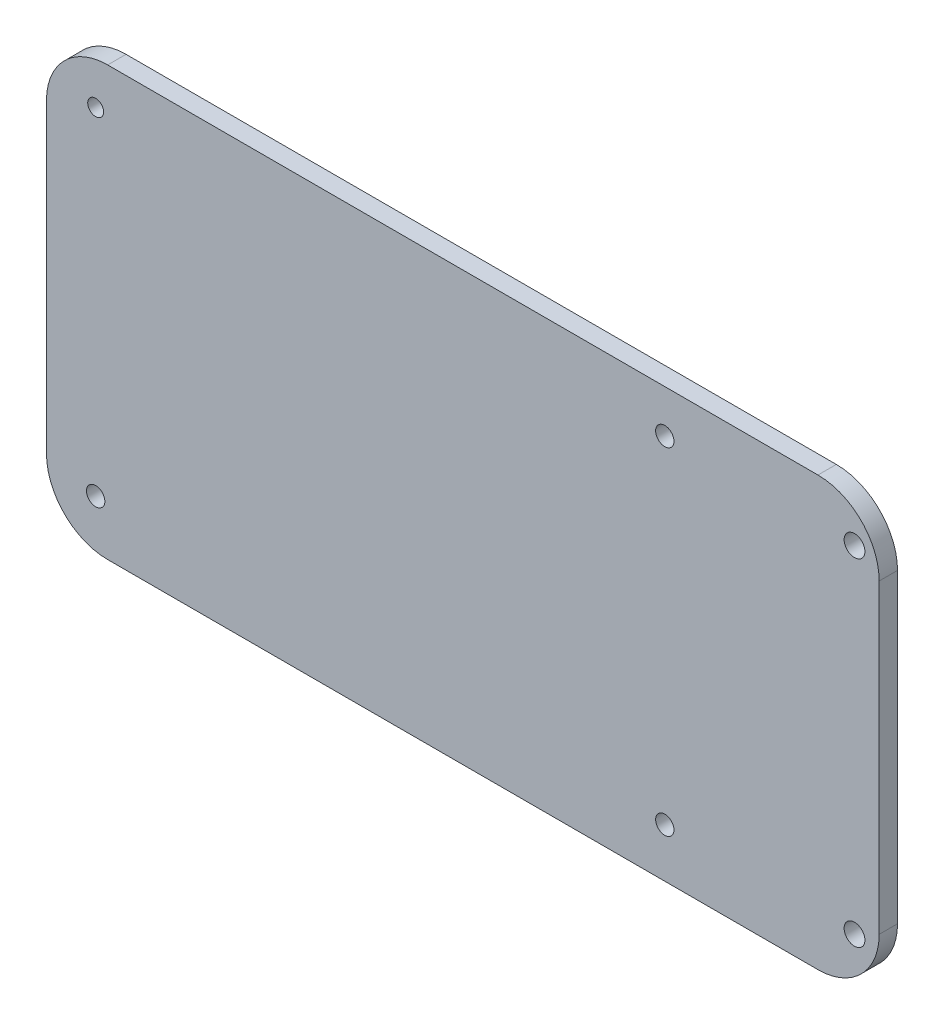
ISO-10303-21;
HEADER;
FILE_DESCRIPTION(('STEP AP214'),'2;1');
FILE_NAME('part.step','',(''),(''),'','','');
FILE_SCHEMA(('AUTOMOTIVE_DESIGN { 1 0 10303 214 1 1 1 1 }'));
ENDSEC;
DATA;
#1=APPLICATION_CONTEXT('core data for automotive mechanical design processes');
#2=APPLICATION_PROTOCOL_DEFINITION('international standard','automotive_design',2000,#1);
#3=PRODUCT_CONTEXT('',#1,'mechanical');
#4=PRODUCT('Part','Part','',(#3));
#5=PRODUCT_RELATED_PRODUCT_CATEGORY('part','',(#4));
#6=PRODUCT_DEFINITION_FORMATION('','',#4);
#7=PRODUCT_DEFINITION_CONTEXT('part definition',#1,'design');
#8=PRODUCT_DEFINITION('design','',#6,#7);
#9=PRODUCT_DEFINITION_SHAPE('','',#8);
#10=(LENGTH_UNIT() NAMED_UNIT(*) SI_UNIT(.MILLI.,.METRE.));
#11=(NAMED_UNIT(*) PLANE_ANGLE_UNIT() SI_UNIT($,.RADIAN.));
#12=(NAMED_UNIT(*) SI_UNIT($,.STERADIAN.) SOLID_ANGLE_UNIT());
#13=UNCERTAINTY_MEASURE_WITH_UNIT(LENGTH_MEASURE(1.E-05),#10,'distance_accuracy_value','');
#14=(GEOMETRIC_REPRESENTATION_CONTEXT(3) GLOBAL_UNCERTAINTY_ASSIGNED_CONTEXT((#13)) GLOBAL_UNIT_ASSIGNED_CONTEXT((#10,
#11,#12)) REPRESENTATION_CONTEXT('',''));
#15=CARTESIAN_POINT('',(0.,0.,0.));
#16=DIRECTION('',(0.,0.,1.));
#17=DIRECTION('',(1.,0.,0.));
#18=AXIS2_PLACEMENT_3D('',#15,#16,#17);
#19=CARTESIAN_POINT('',(59.0949387205515,11.9789527620131,3.));
#20=DIRECTION('',(0.,0.,1.));
#21=DIRECTION('',(1.,0.,0.));
#22=AXIS2_PLACEMENT_3D('',#19,#20,#21);
#23=PLANE('',#22);
#24=CARTESIAN_POINT('',(65.0658166856361,-40.0210472379869,3.));
#25=DIRECTION('',(0.,0.,-1.));
#26=DIRECTION('',(-1.,0.,0.));
#27=AXIS2_PLACEMENT_3D('',#24,#25,#26);
#28=CIRCLE('',#27,1.69999999999999);
#29=CARTESIAN_POINT('',(63.3658166856361,-40.0210472379869,3.));
#30=VERTEX_POINT('',#29);
#31=EDGE_CURVE('E207',#30,#30,#28,.T.);
#32=ORIENTED_EDGE('',*,*,#31,.T.);
#33=EDGE_LOOP('',(#32));
#34=FACE_BOUND('',#33,.T.);
#35=CARTESIAN_POINT('',(65.0658166856361,14.9789527620131,3.));
#36=DIRECTION('',(0.,0.,-1.));
#37=DIRECTION('',(-1.,0.,0.));
#38=AXIS2_PLACEMENT_3D('',#35,#36,#37);
#39=CIRCLE('',#38,1.69999999999999);
#40=CARTESIAN_POINT('',(63.3658166856361,14.9789527620131,3.));
#41=VERTEX_POINT('',#40);
#42=EDGE_CURVE('E199',#41,#41,#39,.T.);
#43=ORIENTED_EDGE('',*,*,#42,.T.);
#44=EDGE_LOOP('',(#43));
#45=FACE_BOUND('',#44,.T.);
#46=CARTESIAN_POINT('',(34.0682801600807,-40.0210472379869,3.));
#47=DIRECTION('',(0.,0.,1.));
#48=DIRECTION('',(1.,0.,0.));
#49=AXIS2_PLACEMENT_3D('',#46,#47,#48);
#50=CIRCLE('',#49,1.5);
#51=CARTESIAN_POINT('',(35.5682801600807,-40.0210472379869,3.));
#52=VERTEX_POINT('',#51);
#53=EDGE_CURVE('E187',#52,#52,#50,.T.);
#54=ORIENTED_EDGE('',*,*,#53,.F.);
#55=EDGE_LOOP('',(#54));
#56=FACE_BOUND('',#55,.T.);
#57=CARTESIAN_POINT('',(-58.9317198399192,14.9789527620131,3.));
#58=DIRECTION('',(0.,0.,1.));
#59=DIRECTION('',(1.,0.,0.));
#60=AXIS2_PLACEMENT_3D('',#57,#58,#59);
#61=CIRCLE('',#60,1.29999999999999);
#62=CARTESIAN_POINT('',(-57.6317198399192,14.9789527620131,3.));
#63=VERTEX_POINT('',#62);
#64=EDGE_CURVE('E133',#63,#63,#61,.T.);
#65=ORIENTED_EDGE('',*,*,#64,.F.);
#66=EDGE_LOOP('',(#65));
#67=FACE_BOUND('',#66,.T.);
#68=CARTESIAN_POINT('',(59.0949387205515,11.9789527620131,3.));
#69=DIRECTION('',(0.,0.,1.));
#70=DIRECTION('',(1.,0.,0.));
#71=AXIS2_PLACEMENT_3D('',#68,#69,#70);
#72=CIRCLE('',#71,10.);
#73=CARTESIAN_POINT('',(69.0949387205515,11.9789527620131,3.));
#74=VERTEX_POINT('',#73);
#75=CARTESIAN_POINT('',(59.0949387205515,21.9789527620131,3.));
#76=VERTEX_POINT('',#75);
#77=EDGE_CURVE('E144',#74,#76,#72,.T.);
#78=ORIENTED_EDGE('',*,*,#77,.T.);
#79=DIRECTION('',(-1.,0.,0.));
#80=VECTOR('',#79,1.);
#81=CARTESIAN_POINT('',(59.0949387205515,21.9789527620131,3.));
#82=LINE('',#81,#80);
#83=CARTESIAN_POINT('',(-56.9683201276188,21.9789527620131,3.));
#84=VERTEX_POINT('',#83);
#85=EDGE_CURVE('E92',#76,#84,#82,.T.);
#86=ORIENTED_EDGE('',*,*,#85,.T.);
#87=CARTESIAN_POINT('',(-56.9683201276189,11.9789527620131,3.));
#88=DIRECTION('',(0.,0.,1.));
#89=DIRECTION('',(-1.,0.,0.));
#90=AXIS2_PLACEMENT_3D('',#87,#88,#89);
#91=CIRCLE('',#90,10.);
#92=CARTESIAN_POINT('',(-66.9683201276189,11.978952762013,3.));
#93=VERTEX_POINT('',#92);
#94=EDGE_CURVE('E159',#84,#93,#91,.T.);
#95=ORIENTED_EDGE('',*,*,#94,.T.);
#96=DIRECTION('',(0.,-1.,0.));
#97=VECTOR('',#96,1.);
#98=CARTESIAN_POINT('',(-66.9683201276189,11.978952762013,3.));
#99=LINE('',#98,#97);
#100=CARTESIAN_POINT('',(-66.9683201276189,-38.0210472379869,3.));
#101=VERTEX_POINT('',#100);
#102=EDGE_CURVE('E172',#93,#101,#99,.T.);
#103=ORIENTED_EDGE('',*,*,#102,.T.);
#104=CARTESIAN_POINT('',(-56.9683201276189,-38.0210472379869,3.));
#105=DIRECTION('',(0.,0.,1.));
#106=DIRECTION('',(1.,0.,0.));
#107=AXIS2_PLACEMENT_3D('',#104,#105,#106);
#108=CIRCLE('',#107,9.99999999999999);
#109=CARTESIAN_POINT('',(-56.9683201276188,-48.0210472379869,3.));
#110=VERTEX_POINT('',#109);
#111=EDGE_CURVE('E111',#101,#110,#108,.T.);
#112=ORIENTED_EDGE('',*,*,#111,.T.);
#113=DIRECTION('',(1.,0.,0.));
#114=VECTOR('',#113,1.);
#115=CARTESIAN_POINT('',(-56.9683201276188,-48.0210472379869,3.));
#116=LINE('',#115,#114);
#117=CARTESIAN_POINT('',(59.0949387205516,-48.0210472379869,3.));
#118=VERTEX_POINT('',#117);
#119=EDGE_CURVE('E105',#110,#118,#116,.T.);
#120=ORIENTED_EDGE('',*,*,#119,.T.);
#121=CARTESIAN_POINT('',(59.0949387205515,-38.0210472379869,3.));
#122=DIRECTION('',(0.,0.,1.));
#123=DIRECTION('',(1.,0.,0.));
#124=AXIS2_PLACEMENT_3D('',#121,#122,#123);
#125=CIRCLE('',#124,10.);
#126=CARTESIAN_POINT('',(69.0949387205515,-38.0210472379869,3.));
#127=VERTEX_POINT('',#126);
#128=EDGE_CURVE('E109',#118,#127,#125,.T.);
#129=ORIENTED_EDGE('',*,*,#128,.T.);
#130=DIRECTION('',(0.,1.,0.));
#131=VECTOR('',#130,1.);
#132=CARTESIAN_POINT('',(69.0949387205515,11.9789527620131,3.));
#133=LINE('',#132,#131);
#134=EDGE_CURVE('E49',#127,#74,#133,.T.);
#135=ORIENTED_EDGE('',*,*,#134,.T.);
#136=EDGE_LOOP('',(#78,#86,#95,#103,#112,#120,#129,#135));
#137=FACE_BOUND('',#136,.T.);
#138=CARTESIAN_POINT('',(34.0682801600808,14.9789527620131,3.));
#139=DIRECTION('',(0.,0.,1.));
#140=DIRECTION('',(1.,0.,0.));
#141=AXIS2_PLACEMENT_3D('',#138,#139,#140);
#142=CIRCLE('',#141,1.5);
#143=CARTESIAN_POINT('',(35.5682801600807,14.9789527620131,3.));
#144=VERTEX_POINT('',#143);
#145=EDGE_CURVE('E181',#144,#144,#142,.T.);
#146=ORIENTED_EDGE('',*,*,#145,.F.);
#147=EDGE_LOOP('',(#146));
#148=FACE_BOUND('',#147,.T.);
#149=CARTESIAN_POINT('',(-58.9317198399193,-40.0210472379869,3.));
#150=DIRECTION('',(0.,0.,1.));
#151=DIRECTION('',(1.,0.,0.));
#152=AXIS2_PLACEMENT_3D('',#149,#150,#151);
#153=CIRCLE('',#152,1.5);
#154=CARTESIAN_POINT('',(-57.4317198399193,-40.0210472379869,3.));
#155=VERTEX_POINT('',#154);
#156=EDGE_CURVE('E193',#155,#155,#153,.T.);
#157=ORIENTED_EDGE('',*,*,#156,.F.);
#158=EDGE_LOOP('',(#157));
#159=FACE_BOUND('',#158,.T.);
#160=ADVANCED_FACE('F32',(#34,#45,#56,#67,#137,#148,#159),#23,.T.);
#161=CARTESIAN_POINT('',(59.0949387205515,11.9789527620131,0.));
#162=DIRECTION('',(0.,0.,1.));
#163=DIRECTION('',(1.,0.,0.));
#164=AXIS2_PLACEMENT_3D('',#161,#162,#163);
#165=PLANE('',#164);
#166=CARTESIAN_POINT('',(65.0658166856361,-40.0210472379869,0.));
#167=DIRECTION('',(0.,0.,-1.));
#168=DIRECTION('',(-1.,0.,0.));
#169=AXIS2_PLACEMENT_3D('',#166,#167,#168);
#170=CIRCLE('',#169,1.69999999999999);
#171=CARTESIAN_POINT('',(63.3658166856361,-40.0210472379869,0.));
#172=VERTEX_POINT('',#171);
#173=EDGE_CURVE('E210',#172,#172,#170,.T.);
#174=ORIENTED_EDGE('',*,*,#173,.F.);
#175=EDGE_LOOP('',(#174));
#176=FACE_BOUND('',#175,.T.);
#177=CARTESIAN_POINT('',(65.0658166856361,14.9789527620131,0.));
#178=DIRECTION('',(0.,0.,-1.));
#179=DIRECTION('',(-1.,0.,0.));
#180=AXIS2_PLACEMENT_3D('',#177,#178,#179);
#181=CIRCLE('',#180,1.69999999999999);
#182=CARTESIAN_POINT('',(63.3658166856361,14.9789527620131,0.));
#183=VERTEX_POINT('',#182);
#184=EDGE_CURVE('E204',#183,#183,#181,.T.);
#185=ORIENTED_EDGE('',*,*,#184,.F.);
#186=EDGE_LOOP('',(#185));
#187=FACE_BOUND('',#186,.T.);
#188=CARTESIAN_POINT('',(34.0682801600807,-40.0210472379869,0.));
#189=DIRECTION('',(0.,0.,1.));
#190=DIRECTION('',(1.,0.,0.));
#191=AXIS2_PLACEMENT_3D('',#188,#189,#190);
#192=CIRCLE('',#191,1.5);
#193=CARTESIAN_POINT('',(35.5682801600807,-40.0210472379869,0.));
#194=VERTEX_POINT('',#193);
#195=EDGE_CURVE('E190',#194,#194,#192,.T.);
#196=ORIENTED_EDGE('',*,*,#195,.T.);
#197=EDGE_LOOP('',(#196));
#198=FACE_BOUND('',#197,.T.);
#199=CARTESIAN_POINT('',(-58.9317198399192,14.9789527620131,0.));
#200=DIRECTION('',(0.,0.,1.));
#201=DIRECTION('',(1.,0.,0.));
#202=AXIS2_PLACEMENT_3D('',#199,#200,#201);
#203=CIRCLE('',#202,1.29999999999999);
#204=CARTESIAN_POINT('',(-57.6317198399192,14.9789527620131,0.));
#205=VERTEX_POINT('',#204);
#206=EDGE_CURVE('E178',#205,#205,#203,.T.);
#207=ORIENTED_EDGE('',*,*,#206,.T.);
#208=EDGE_LOOP('',(#207));
#209=FACE_BOUND('',#208,.T.);
#210=CARTESIAN_POINT('',(59.0949387205515,11.9789527620131,0.));
#211=DIRECTION('',(0.,0.,1.));
#212=DIRECTION('',(1.,0.,0.));
#213=AXIS2_PLACEMENT_3D('',#210,#211,#212);
#214=CIRCLE('',#213,10.);
#215=CARTESIAN_POINT('',(69.0949387205515,11.9789527620131,0.));
#216=VERTEX_POINT('',#215);
#217=CARTESIAN_POINT('',(59.0949387205515,21.9789527620131,0.));
#218=VERTEX_POINT('',#217);
#219=EDGE_CURVE('E129',#216,#218,#214,.T.);
#220=ORIENTED_EDGE('',*,*,#219,.F.);
#221=DIRECTION('',(0.,1.,0.));
#222=VECTOR('',#221,1.);
#223=CARTESIAN_POINT('',(69.0949387205515,11.9789527620131,0.));
#224=LINE('',#223,#222);
#225=CARTESIAN_POINT('',(69.0949387205515,-38.0210472379869,0.));
#226=VERTEX_POINT('',#225);
#227=EDGE_CURVE('E84',#226,#216,#224,.T.);
#228=ORIENTED_EDGE('',*,*,#227,.F.);
#229=CARTESIAN_POINT('',(59.0949387205515,-38.0210472379869,0.));
#230=DIRECTION('',(0.,0.,1.));
#231=DIRECTION('',(1.,0.,0.));
#232=AXIS2_PLACEMENT_3D('',#229,#230,#231);
#233=CIRCLE('',#232,10.);
#234=CARTESIAN_POINT('',(59.0949387205516,-48.0210472379869,0.));
#235=VERTEX_POINT('',#234);
#236=EDGE_CURVE('E78',#235,#226,#233,.T.);
#237=ORIENTED_EDGE('',*,*,#236,.F.);
#238=DIRECTION('',(1.,0.,0.));
#239=VECTOR('',#238,1.);
#240=CARTESIAN_POINT('',(-56.9683201276188,-48.0210472379869,0.));
#241=LINE('',#240,#239);
#242=CARTESIAN_POINT('',(-56.9683201276188,-48.0210472379869,0.));
#243=VERTEX_POINT('',#242);
#244=EDGE_CURVE('E119',#243,#235,#241,.T.);
#245=ORIENTED_EDGE('',*,*,#244,.F.);
#246=CARTESIAN_POINT('',(-56.9683201276189,-38.0210472379869,0.));
#247=DIRECTION('',(0.,0.,1.));
#248=DIRECTION('',(1.,0.,0.));
#249=AXIS2_PLACEMENT_3D('',#246,#247,#248);
#250=CIRCLE('',#249,9.99999999999999);
#251=CARTESIAN_POINT('',(-66.9683201276189,-38.0210472379869,0.));
#252=VERTEX_POINT('',#251);
#253=EDGE_CURVE('E139',#252,#243,#250,.T.);
#254=ORIENTED_EDGE('',*,*,#253,.F.);
#255=DIRECTION('',(0.,-1.,0.));
#256=VECTOR('',#255,1.);
#257=CARTESIAN_POINT('',(-66.9683201276189,11.978952762013,0.));
#258=LINE('',#257,#256);
#259=CARTESIAN_POINT('',(-66.9683201276189,11.978952762013,0.));
#260=VERTEX_POINT('',#259);
#261=EDGE_CURVE('E137',#260,#252,#258,.T.);
#262=ORIENTED_EDGE('',*,*,#261,.F.);
#263=CARTESIAN_POINT('',(-56.9683201276189,11.9789527620131,0.));
#264=DIRECTION('',(0.,0.,1.));
#265=DIRECTION('',(-1.,0.,0.));
#266=AXIS2_PLACEMENT_3D('',#263,#264,#265);
#267=CIRCLE('',#266,10.);
#268=CARTESIAN_POINT('',(-56.9683201276188,21.9789527620131,0.));
#269=VERTEX_POINT('',#268);
#270=EDGE_CURVE('E135',#269,#260,#267,.T.);
#271=ORIENTED_EDGE('',*,*,#270,.F.);
#272=DIRECTION('',(-1.,0.,0.));
#273=VECTOR('',#272,1.);
#274=CARTESIAN_POINT('',(59.0949387205515,21.9789527620131,0.));
#275=LINE('',#274,#273);
#276=EDGE_CURVE('E132',#218,#269,#275,.T.);
#277=ORIENTED_EDGE('',*,*,#276,.F.);
#278=EDGE_LOOP('',(#220,#228,#237,#245,#254,#262,#271,#277));
#279=FACE_BOUND('',#278,.T.);
#280=CARTESIAN_POINT('',(34.0682801600808,14.9789527620131,0.));
#281=DIRECTION('',(0.,0.,1.));
#282=DIRECTION('',(1.,0.,0.));
#283=AXIS2_PLACEMENT_3D('',#280,#281,#282);
#284=CIRCLE('',#283,1.5);
#285=CARTESIAN_POINT('',(35.5682801600807,14.9789527620131,0.));
#286=VERTEX_POINT('',#285);
#287=EDGE_CURVE('E184',#286,#286,#284,.T.);
#288=ORIENTED_EDGE('',*,*,#287,.T.);
#289=EDGE_LOOP('',(#288));
#290=FACE_BOUND('',#289,.T.);
#291=CARTESIAN_POINT('',(-58.9317198399193,-40.0210472379869,0.));
#292=DIRECTION('',(0.,0.,1.));
#293=DIRECTION('',(1.,0.,0.));
#294=AXIS2_PLACEMENT_3D('',#291,#292,#293);
#295=CIRCLE('',#294,1.5);
#296=CARTESIAN_POINT('',(-57.4317198399193,-40.0210472379869,0.));
#297=VERTEX_POINT('',#296);
#298=EDGE_CURVE('E196',#297,#297,#295,.T.);
#299=ORIENTED_EDGE('',*,*,#298,.T.);
#300=EDGE_LOOP('',(#299));
#301=FACE_BOUND('',#300,.T.);
#302=ADVANCED_FACE('F163',(#176,#187,#198,#209,#279,#290,#301),#165,.F.);
#303=CARTESIAN_POINT('',(59.0949387205515,11.9789527620131,3.));
#304=DIRECTION('',(0.,0.,-1.));
#305=DIRECTION('',(-1.,0.,0.));
#306=AXIS2_PLACEMENT_3D('',#303,#304,#305);
#307=CYLINDRICAL_SURFACE('',#306,10.);
#308=ORIENTED_EDGE('',*,*,#219,.T.);
#309=DIRECTION('',(0.,0.,-1.));
#310=VECTOR('',#309,1.);
#311=CARTESIAN_POINT('',(59.0949387205515,21.9789527620131,3.));
#312=LINE('',#311,#310);
#313=EDGE_CURVE('E11',#76,#218,#312,.T.);
#314=ORIENTED_EDGE('',*,*,#313,.F.);
#315=ORIENTED_EDGE('',*,*,#77,.F.);
#316=DIRECTION('',(0.,0.,-1.));
#317=VECTOR('',#316,1.);
#318=CARTESIAN_POINT('',(69.0949387205515,11.9789527620131,3.));
#319=LINE('',#318,#317);
#320=EDGE_CURVE('E125',#74,#216,#319,.T.);
#321=ORIENTED_EDGE('',*,*,#320,.T.);
#322=EDGE_LOOP('',(#308,#314,#315,#321));
#323=FACE_BOUND('',#322,.T.);
#324=ADVANCED_FACE('F34',(#323),#307,.T.);
#325=CARTESIAN_POINT('',(59.0949387205515,21.9789527620131,3.));
#326=DIRECTION('',(0.,-1.,0.));
#327=DIRECTION('',(1.,0.,0.));
#328=AXIS2_PLACEMENT_3D('',#325,#326,#327);
#329=PLANE('',#328);
#330=ORIENTED_EDGE('',*,*,#276,.T.);
#331=DIRECTION('',(0.,0.,-1.));
#332=VECTOR('',#331,1.);
#333=CARTESIAN_POINT('',(-56.9683201276188,21.9789527620131,3.));
#334=LINE('',#333,#332);
#335=EDGE_CURVE('E41',#84,#269,#334,.T.);
#336=ORIENTED_EDGE('',*,*,#335,.F.);
#337=ORIENTED_EDGE('',*,*,#85,.F.);
#338=ORIENTED_EDGE('',*,*,#313,.T.);
#339=EDGE_LOOP('',(#330,#336,#337,#338));
#340=FACE_BOUND('',#339,.T.);
#341=ADVANCED_FACE('F255',(#340),#329,.F.);
#342=CARTESIAN_POINT('',(-56.9683201276189,11.9789527620131,3.));
#343=DIRECTION('',(0.,0.,-1.));
#344=DIRECTION('',(-1.,0.,0.));
#345=AXIS2_PLACEMENT_3D('',#342,#343,#344);
#346=CYLINDRICAL_SURFACE('',#345,10.);
#347=ORIENTED_EDGE('',*,*,#270,.T.);
#348=DIRECTION('',(0.,0.,-1.));
#349=VECTOR('',#348,1.);
#350=CARTESIAN_POINT('',(-66.9683201276189,11.978952762013,3.));
#351=LINE('',#350,#349);
#352=EDGE_CURVE('E151',#93,#260,#351,.T.);
#353=ORIENTED_EDGE('',*,*,#352,.F.);
#354=ORIENTED_EDGE('',*,*,#94,.F.);
#355=ORIENTED_EDGE('',*,*,#335,.T.);
#356=EDGE_LOOP('',(#347,#353,#354,#355));
#357=FACE_BOUND('',#356,.T.);
#358=ADVANCED_FACE('F157',(#357),#346,.T.);
#359=CARTESIAN_POINT('',(-66.9683201276189,11.978952762013,3.));
#360=DIRECTION('',(1.,0.,0.));
#361=DIRECTION('',(0.,0.,-1.));
#362=AXIS2_PLACEMENT_3D('',#359,#360,#361);
#363=PLANE('',#362);
#364=ORIENTED_EDGE('',*,*,#261,.T.);
#365=DIRECTION('',(0.,0.,-1.));
#366=VECTOR('',#365,1.);
#367=CARTESIAN_POINT('',(-66.9683201276189,-38.0210472379869,3.));
#368=LINE('',#367,#366);
#369=EDGE_CURVE('E148',#101,#252,#368,.T.);
#370=ORIENTED_EDGE('',*,*,#369,.F.);
#371=ORIENTED_EDGE('',*,*,#102,.F.);
#372=ORIENTED_EDGE('',*,*,#352,.T.);
#373=EDGE_LOOP('',(#364,#370,#371,#372));
#374=FACE_BOUND('',#373,.T.);
#375=ADVANCED_FACE('F168',(#374),#363,.F.);
#376=CARTESIAN_POINT('',(-56.9683201276189,-38.0210472379869,3.));
#377=DIRECTION('',(0.,0.,-1.));
#378=DIRECTION('',(-1.,0.,0.));
#379=AXIS2_PLACEMENT_3D('',#376,#377,#378);
#380=CYLINDRICAL_SURFACE('',#379,9.99999999999999);
#381=ORIENTED_EDGE('',*,*,#253,.T.);
#382=DIRECTION('',(0.,0.,-1.));
#383=VECTOR('',#382,1.);
#384=CARTESIAN_POINT('',(-56.9683201276188,-48.0210472379869,3.));
#385=LINE('',#384,#383);
#386=EDGE_CURVE('E120',#110,#243,#385,.T.);
#387=ORIENTED_EDGE('',*,*,#386,.F.);
#388=ORIENTED_EDGE('',*,*,#111,.F.);
#389=ORIENTED_EDGE('',*,*,#369,.T.);
#390=EDGE_LOOP('',(#381,#387,#388,#389));
#391=FACE_BOUND('',#390,.T.);
#392=ADVANCED_FACE('F171',(#391),#380,.T.);
#393=CARTESIAN_POINT('',(-56.9683201276188,-48.0210472379869,3.));
#394=DIRECTION('',(0.,1.,0.));
#395=DIRECTION('',(0.,0.,1.));
#396=AXIS2_PLACEMENT_3D('',#393,#394,#395);
#397=PLANE('',#396);
#398=ORIENTED_EDGE('',*,*,#244,.T.);
#399=DIRECTION('',(0.,0.,-1.));
#400=VECTOR('',#399,1.);
#401=CARTESIAN_POINT('',(59.0949387205516,-48.0210472379869,3.));
#402=LINE('',#401,#400);
#403=EDGE_CURVE('E116',#118,#235,#402,.T.);
#404=ORIENTED_EDGE('',*,*,#403,.F.);
#405=ORIENTED_EDGE('',*,*,#119,.F.);
#406=ORIENTED_EDGE('',*,*,#386,.T.);
#407=EDGE_LOOP('',(#398,#404,#405,#406));
#408=FACE_BOUND('',#407,.T.);
#409=ADVANCED_FACE('F117',(#408),#397,.F.);
#410=CARTESIAN_POINT('',(59.0949387205515,-38.0210472379869,3.));
#411=DIRECTION('',(0.,0.,-1.));
#412=DIRECTION('',(-1.,0.,0.));
#413=AXIS2_PLACEMENT_3D('',#410,#411,#412);
#414=CYLINDRICAL_SURFACE('',#413,10.);
#415=ORIENTED_EDGE('',*,*,#236,.T.);
#416=DIRECTION('',(0.,0.,-1.));
#417=VECTOR('',#416,1.);
#418=CARTESIAN_POINT('',(69.0949387205515,-38.0210472379869,3.));
#419=LINE('',#418,#417);
#420=EDGE_CURVE('E121',#127,#226,#419,.T.);
#421=ORIENTED_EDGE('',*,*,#420,.F.);
#422=ORIENTED_EDGE('',*,*,#128,.F.);
#423=ORIENTED_EDGE('',*,*,#403,.T.);
#424=EDGE_LOOP('',(#415,#421,#422,#423));
#425=FACE_BOUND('',#424,.T.);
#426=ADVANCED_FACE('F123',(#425),#414,.T.);
#427=CARTESIAN_POINT('',(69.0949387205515,11.9789527620131,3.));
#428=DIRECTION('',(-1.,0.,0.));
#429=DIRECTION('',(0.,0.,1.));
#430=AXIS2_PLACEMENT_3D('',#427,#428,#429);
#431=PLANE('',#430);
#432=ORIENTED_EDGE('',*,*,#227,.T.);
#433=ORIENTED_EDGE('',*,*,#320,.F.);
#434=ORIENTED_EDGE('',*,*,#134,.F.);
#435=ORIENTED_EDGE('',*,*,#420,.T.);
#436=EDGE_LOOP('',(#432,#433,#434,#435));
#437=FACE_BOUND('',#436,.T.);
#438=ADVANCED_FACE('F228',(#437),#431,.F.);
#439=CARTESIAN_POINT('',(-58.9317198399192,14.9789527620131,3.));
#440=DIRECTION('',(0.,0.,-1.));
#441=DIRECTION('',(-1.,0.,0.));
#442=AXIS2_PLACEMENT_3D('',#439,#440,#441);
#443=CYLINDRICAL_SURFACE('',#442,1.29999999999999);
#444=ORIENTED_EDGE('',*,*,#64,.T.);
#445=EDGE_LOOP('',(#444));
#446=FACE_BOUND('',#445,.T.);
#447=ORIENTED_EDGE('',*,*,#206,.F.);
#448=EDGE_LOOP('',(#447));
#449=FACE_BOUND('',#448,.T.);
#450=ADVANCED_FACE('F225',(#446,#449),#443,.F.);
#451=CARTESIAN_POINT('',(34.0682801600808,14.9789527620131,3.));
#452=DIRECTION('',(0.,0.,-1.));
#453=DIRECTION('',(-1.,0.,0.));
#454=AXIS2_PLACEMENT_3D('',#451,#452,#453);
#455=CYLINDRICAL_SURFACE('',#454,1.5);
#456=ORIENTED_EDGE('',*,*,#145,.T.);
#457=EDGE_LOOP('',(#456));
#458=FACE_BOUND('',#457,.T.);
#459=ORIENTED_EDGE('',*,*,#287,.F.);
#460=EDGE_LOOP('',(#459));
#461=FACE_BOUND('',#460,.T.);
#462=ADVANCED_FACE('F227',(#458,#461),#455,.F.);
#463=CARTESIAN_POINT('',(34.0682801600807,-40.0210472379869,3.));
#464=DIRECTION('',(0.,0.,-1.));
#465=DIRECTION('',(-1.,0.,0.));
#466=AXIS2_PLACEMENT_3D('',#463,#464,#465);
#467=CYLINDRICAL_SURFACE('',#466,1.5);
#468=ORIENTED_EDGE('',*,*,#53,.T.);
#469=EDGE_LOOP('',(#468));
#470=FACE_BOUND('',#469,.T.);
#471=ORIENTED_EDGE('',*,*,#195,.F.);
#472=EDGE_LOOP('',(#471));
#473=FACE_BOUND('',#472,.T.);
#474=ADVANCED_FACE('F235',(#470,#473),#467,.F.);
#475=CARTESIAN_POINT('',(-58.9317198399193,-40.0210472379869,3.));
#476=DIRECTION('',(0.,0.,-1.));
#477=DIRECTION('',(-1.,0.,0.));
#478=AXIS2_PLACEMENT_3D('',#475,#476,#477);
#479=CYLINDRICAL_SURFACE('',#478,1.5);
#480=ORIENTED_EDGE('',*,*,#156,.T.);
#481=EDGE_LOOP('',(#480));
#482=FACE_BOUND('',#481,.T.);
#483=ORIENTED_EDGE('',*,*,#298,.F.);
#484=EDGE_LOOP('',(#483));
#485=FACE_BOUND('',#484,.T.);
#486=ADVANCED_FACE('F282',(#482,#485),#479,.F.);
#487=CARTESIAN_POINT('',(65.0658166856361,14.9789527620131,0.));
#488=DIRECTION('',(0.,0.,-1.));
#489=DIRECTION('',(-1.,0.,0.));
#490=AXIS2_PLACEMENT_3D('',#487,#488,#489);
#491=CYLINDRICAL_SURFACE('',#490,1.69999999999999);
#492=ORIENTED_EDGE('',*,*,#42,.F.);
#493=EDGE_LOOP('',(#492));
#494=FACE_BOUND('',#493,.T.);
#495=ORIENTED_EDGE('',*,*,#184,.T.);
#496=EDGE_LOOP('',(#495));
#497=FACE_BOUND('',#496,.T.);
#498=ADVANCED_FACE('F277',(#494,#497),#491,.F.);
#499=CARTESIAN_POINT('',(65.0658166856361,-40.0210472379869,0.));
#500=DIRECTION('',(0.,0.,-1.));
#501=DIRECTION('',(-1.,0.,0.));
#502=AXIS2_PLACEMENT_3D('',#499,#500,#501);
#503=CYLINDRICAL_SURFACE('',#502,1.69999999999999);
#504=ORIENTED_EDGE('',*,*,#31,.F.);
#505=EDGE_LOOP('',(#504));
#506=FACE_BOUND('',#505,.T.);
#507=ORIENTED_EDGE('',*,*,#173,.T.);
#508=EDGE_LOOP('',(#507));
#509=FACE_BOUND('',#508,.T.);
#510=ADVANCED_FACE('F214',(#506,#509),#503,.F.);
#511=CLOSED_SHELL('',(#160,#302,#324,#341,#358,#375,#392,#409,#426,#438,#450,#462,#474,#486,
#498,#510));
#512=MANIFOLD_SOLID_BREP('B2',#511);
#513=ADVANCED_BREP_SHAPE_REPRESENTATION('',(#18,#512),#14);
#514=SHAPE_DEFINITION_REPRESENTATION(#9,#513);
ENDSEC;
END-ISO-10303-21;
